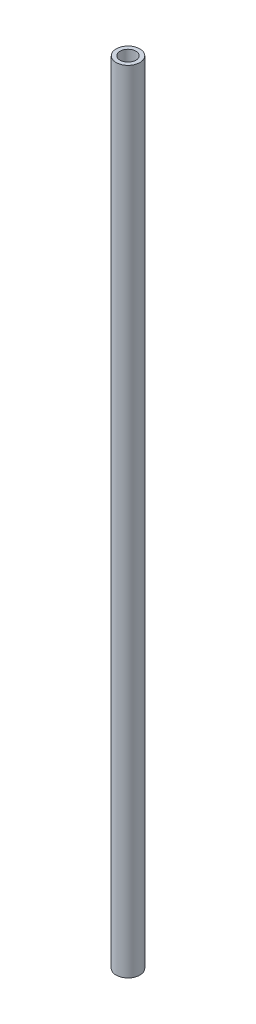
ISO-10303-21;
HEADER;
FILE_DESCRIPTION(('STEP AP214'),'2;1');
FILE_NAME('part.step','',(''),(''),'','','');
FILE_SCHEMA(('AUTOMOTIVE_DESIGN { 1 0 10303 214 1 1 1 1 }'));
ENDSEC;
DATA;
#1=APPLICATION_CONTEXT('core data for automotive mechanical design processes');
#2=APPLICATION_PROTOCOL_DEFINITION('international standard','automotive_design',2000,#1);
#3=PRODUCT_CONTEXT('',#1,'mechanical');
#4=PRODUCT('Part','Part','',(#3));
#5=PRODUCT_RELATED_PRODUCT_CATEGORY('part','',(#4));
#6=PRODUCT_DEFINITION_FORMATION('','',#4);
#7=PRODUCT_DEFINITION_CONTEXT('part definition',#1,'design');
#8=PRODUCT_DEFINITION('design','',#6,#7);
#9=PRODUCT_DEFINITION_SHAPE('','',#8);
#10=(LENGTH_UNIT() NAMED_UNIT(*) SI_UNIT(.MILLI.,.METRE.));
#11=(NAMED_UNIT(*) PLANE_ANGLE_UNIT() SI_UNIT($,.RADIAN.));
#12=(NAMED_UNIT(*) SI_UNIT($,.STERADIAN.) SOLID_ANGLE_UNIT());
#13=UNCERTAINTY_MEASURE_WITH_UNIT(LENGTH_MEASURE(1.E-05),#10,'distance_accuracy_value','');
#14=(GEOMETRIC_REPRESENTATION_CONTEXT(3) GLOBAL_UNCERTAINTY_ASSIGNED_CONTEXT((#13)) GLOBAL_UNIT_ASSIGNED_CONTEXT((#10,
#11,#12)) REPRESENTATION_CONTEXT('',''));
#15=CARTESIAN_POINT('',(0.,0.,0.));
#16=DIRECTION('',(0.,0.,1.));
#17=DIRECTION('',(1.,0.,0.));
#18=AXIS2_PLACEMENT_3D('',#15,#16,#17);
#19=CARTESIAN_POINT('',(0.,200.,0.));
#20=DIRECTION('',(0.,-1.,0.));
#21=DIRECTION('',(0.,0.,-1.));
#22=AXIS2_PLACEMENT_3D('',#19,#20,#21);
#23=CYLINDRICAL_SURFACE('',#22,2.);
#24=CARTESIAN_POINT('',(0.,190.,0.));
#25=DIRECTION('',(0.,1.,0.));
#26=DIRECTION('',(0.,0.,1.));
#27=AXIS2_PLACEMENT_3D('',#24,#25,#26);
#28=CIRCLE('',#27,2.);
#29=CARTESIAN_POINT('',(0.,190.,2.));
#30=VERTEX_POINT('',#29);
#31=EDGE_CURVE('E10',#30,#30,#28,.T.);
#32=ORIENTED_EDGE('',*,*,#31,.F.);
#33=EDGE_LOOP('',(#32));
#34=FACE_BOUND('',#33,.T.);
#35=CARTESIAN_POINT('',(0.,200.,0.));
#36=DIRECTION('',(0.,1.,0.));
#37=DIRECTION('',(0.,0.,1.));
#38=AXIS2_PLACEMENT_3D('',#35,#36,#37);
#39=CIRCLE('',#38,2.);
#40=CARTESIAN_POINT('',(0.,200.,2.));
#41=VERTEX_POINT('',#40);
#42=EDGE_CURVE('E52',#41,#41,#39,.T.);
#43=ORIENTED_EDGE('',*,*,#42,.T.);
#44=EDGE_LOOP('',(#43));
#45=FACE_BOUND('',#44,.T.);
#46=ADVANCED_FACE('F32',(#34,#45),#23,.F.);
#47=CARTESIAN_POINT('',(0.,200.,0.));
#48=DIRECTION('',(0.,1.,0.));
#49=DIRECTION('',(0.,0.,1.));
#50=AXIS2_PLACEMENT_3D('',#47,#48,#49);
#51=PLANE('',#50);
#52=CARTESIAN_POINT('',(0.,200.,0.));
#53=DIRECTION('',(0.,1.,0.));
#54=DIRECTION('',(0.,0.,1.));
#55=AXIS2_PLACEMENT_3D('',#52,#53,#54);
#56=CIRCLE('',#55,3.);
#57=CARTESIAN_POINT('',(0.,200.,3.));
#58=VERTEX_POINT('',#57);
#59=EDGE_CURVE('E44',#58,#58,#56,.T.);
#60=ORIENTED_EDGE('',*,*,#59,.T.);
#61=EDGE_LOOP('',(#60));
#62=FACE_BOUND('',#61,.T.);
#63=ORIENTED_EDGE('',*,*,#42,.F.);
#64=EDGE_LOOP('',(#63));
#65=FACE_BOUND('',#64,.T.);
#66=ADVANCED_FACE('F89',(#62,#65),#51,.T.);
#67=CARTESIAN_POINT('',(0.,0.,0.));
#68=DIRECTION('',(0.,1.,0.));
#69=DIRECTION('',(0.,0.,1.));
#70=AXIS2_PLACEMENT_3D('',#67,#68,#69);
#71=PLANE('',#70);
#72=CARTESIAN_POINT('',(0.,0.,0.));
#73=DIRECTION('',(0.,1.,0.));
#74=DIRECTION('',(0.,0.,1.));
#75=AXIS2_PLACEMENT_3D('',#72,#73,#74);
#76=CIRCLE('',#75,3.);
#77=CARTESIAN_POINT('',(0.,0.,3.));
#78=VERTEX_POINT('',#77);
#79=EDGE_CURVE('E48',#78,#78,#76,.T.);
#80=ORIENTED_EDGE('',*,*,#79,.F.);
#81=EDGE_LOOP('',(#80));
#82=FACE_BOUND('',#81,.T.);
#83=CARTESIAN_POINT('',(0.,0.,0.));
#84=DIRECTION('',(0.,1.,0.));
#85=DIRECTION('',(0.,0.,1.));
#86=AXIS2_PLACEMENT_3D('',#83,#84,#85);
#87=CIRCLE('',#86,2.);
#88=CARTESIAN_POINT('',(0.,0.,2.));
#89=VERTEX_POINT('',#88);
#90=EDGE_CURVE('E54',#89,#89,#87,.T.);
#91=ORIENTED_EDGE('',*,*,#90,.T.);
#92=EDGE_LOOP('',(#91));
#93=FACE_BOUND('',#92,.T.);
#94=ADVANCED_FACE('F91',(#82,#93),#71,.F.);
#95=CARTESIAN_POINT('',(0.,200.,0.));
#96=DIRECTION('',(0.,-1.,0.));
#97=DIRECTION('',(0.,0.,-1.));
#98=AXIS2_PLACEMENT_3D('',#95,#96,#97);
#99=CYLINDRICAL_SURFACE('',#98,3.);
#100=ORIENTED_EDGE('',*,*,#59,.F.);
#101=EDGE_LOOP('',(#100));
#102=FACE_BOUND('',#101,.T.);
#103=ORIENTED_EDGE('',*,*,#79,.T.);
#104=EDGE_LOOP('',(#103));
#105=FACE_BOUND('',#104,.T.);
#106=ADVANCED_FACE('F34',(#102,#105),#99,.T.);
#107=CARTESIAN_POINT('',(0.,10.,0.));
#108=DIRECTION('',(0.,-1.,0.));
#109=DIRECTION('',(0.,0.,-1.));
#110=AXIS2_PLACEMENT_3D('',#107,#108,#109);
#111=CIRCLE('',#110,2.);
#112=CARTESIAN_POINT('',(0.,10.,-2.));
#113=VERTEX_POINT('',#112);
#114=EDGE_CURVE('E40',#113,#113,#111,.T.);
#115=ORIENTED_EDGE('',*,*,#114,.F.);
#116=EDGE_LOOP('',(#115));
#117=FACE_BOUND('',#116,.T.);
#118=ORIENTED_EDGE('',*,*,#90,.F.);
#119=EDGE_LOOP('',(#118));
#120=FACE_BOUND('',#119,.T.);
#121=ADVANCED_FACE('F85',(#117,#120),#23,.F.);
#122=CARTESIAN_POINT('',(0.,10.,0.));
#123=DIRECTION('',(0.,-1.,0.));
#124=DIRECTION('',(0.,0.,-1.));
#125=AXIS2_PLACEMENT_3D('',#122,#123,#124);
#126=PLANE('',#125);
#127=ORIENTED_EDGE('',*,*,#114,.T.);
#128=EDGE_LOOP('',(#127));
#129=FACE_BOUND('',#128,.T.);
#130=ADVANCED_FACE('F81',(#129),#126,.T.);
#131=CARTESIAN_POINT('',(0.,190.,0.));
#132=DIRECTION('',(0.,1.,0.));
#133=DIRECTION('',(0.,0.,1.));
#134=AXIS2_PLACEMENT_3D('',#131,#132,#133);
#135=PLANE('',#134);
#136=ORIENTED_EDGE('',*,*,#31,.T.);
#137=EDGE_LOOP('',(#136));
#138=FACE_BOUND('',#137,.T.);
#139=ADVANCED_FACE('F80',(#138),#135,.T.);
#140=CLOSED_SHELL('',(#46,#66,#94,#106,#121,#130,#139));
#141=CARTESIAN_POINT('',(0.,187.,0.));
#142=DIRECTION('',(0.,1.,0.));
#143=DIRECTION('',(0.,0.,1.));
#144=AXIS2_PLACEMENT_3D('',#141,#142,#143);
#145=PLANE('',#144);
#146=CARTESIAN_POINT('',(0.,187.,0.));
#147=DIRECTION('',(0.,1.,0.));
#148=DIRECTION('',(0.,0.,1.));
#149=AXIS2_PLACEMENT_3D('',#146,#147,#148);
#150=CIRCLE('',#149,2.);
#151=CARTESIAN_POINT('',(0.,187.,2.));
#152=VERTEX_POINT('',#151);
#153=EDGE_CURVE('E62',#152,#152,#150,.T.);
#154=ORIENTED_EDGE('',*,*,#153,.F.);
#155=EDGE_LOOP('',(#154));
#156=FACE_BOUND('',#155,.T.);
#157=ADVANCED_FACE('F68',(#156),#145,.F.);
#158=CARTESIAN_POINT('',(0.,13.,0.));
#159=DIRECTION('',(0.,-1.,0.));
#160=DIRECTION('',(0.,0.,-1.));
#161=AXIS2_PLACEMENT_3D('',#158,#159,#160);
#162=PLANE('',#161);
#163=CARTESIAN_POINT('',(0.,13.,0.));
#164=DIRECTION('',(0.,-1.,0.));
#165=DIRECTION('',(0.,0.,-1.));
#166=AXIS2_PLACEMENT_3D('',#163,#164,#165);
#167=CIRCLE('',#166,2.);
#168=CARTESIAN_POINT('',(0.,13.,-2.));
#169=VERTEX_POINT('',#168);
#170=EDGE_CURVE('E57',#169,#169,#167,.T.);
#171=ORIENTED_EDGE('',*,*,#170,.F.);
#172=EDGE_LOOP('',(#171));
#173=FACE_BOUND('',#172,.T.);
#174=ADVANCED_FACE('F70',(#173),#162,.F.);
#175=ORIENTED_EDGE('',*,*,#170,.T.);
#176=EDGE_LOOP('',(#175));
#177=FACE_BOUND('',#176,.T.);
#178=ORIENTED_EDGE('',*,*,#153,.T.);
#179=EDGE_LOOP('',(#178));
#180=FACE_BOUND('',#179,.T.);
#181=ADVANCED_FACE('F66',(#177,#180),#23,.F.);
#182=CLOSED_SHELL('',(#157,#174,#181));
#183=ORIENTED_CLOSED_SHELL('',*,#182,.T.);
#184=BREP_WITH_VOIDS('B2',#140,(#183));
#185=ADVANCED_BREP_SHAPE_REPRESENTATION('',(#18,#184),#14);
#186=SHAPE_DEFINITION_REPRESENTATION(#9,#185);
ENDSEC;
END-ISO-10303-21;
